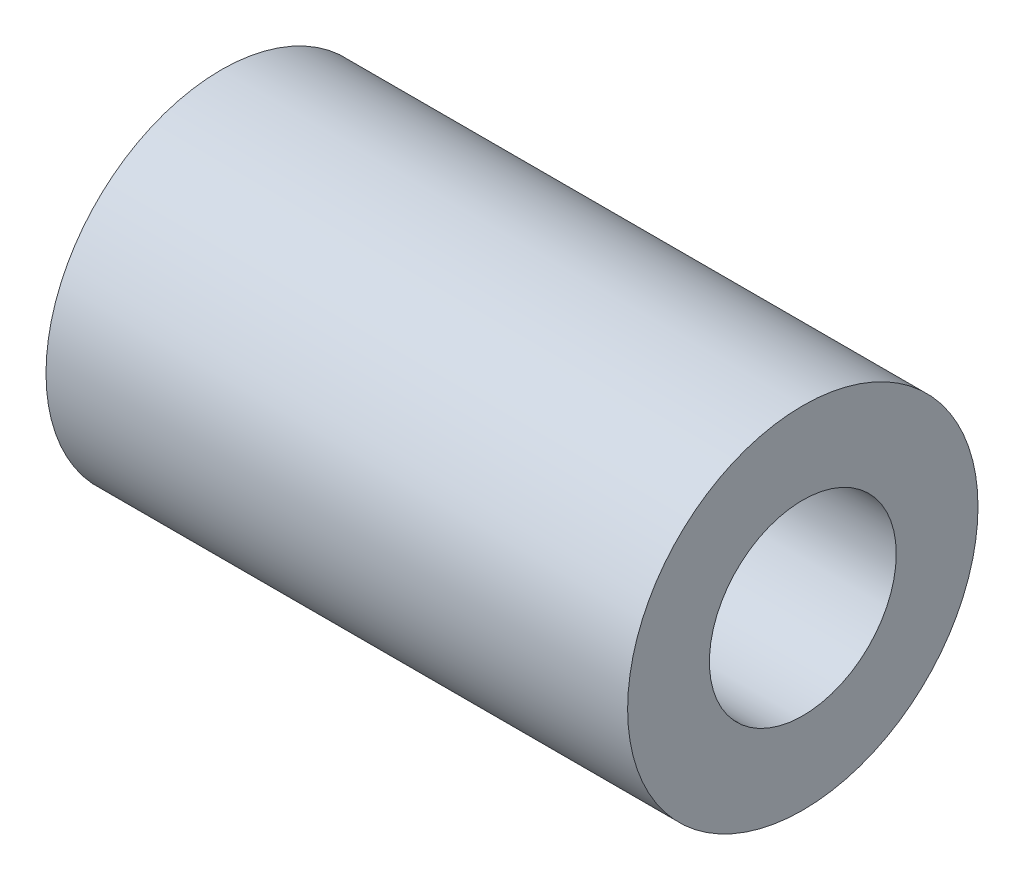
ISO-10303-21;
HEADER;
FILE_DESCRIPTION(('STEP AP214'),'2;1');
FILE_NAME('part.step','',(''),(''),'','','');
FILE_SCHEMA(('AUTOMOTIVE_DESIGN { 1 0 10303 214 1 1 1 1 }'));
ENDSEC;
DATA;
#1=APPLICATION_CONTEXT('core data for automotive mechanical design processes');
#2=APPLICATION_PROTOCOL_DEFINITION('international standard','automotive_design',2000,#1);
#3=PRODUCT_CONTEXT('',#1,'mechanical');
#4=PRODUCT('Part','Part','',(#3));
#5=PRODUCT_RELATED_PRODUCT_CATEGORY('part','',(#4));
#6=PRODUCT_DEFINITION_FORMATION('','',#4);
#7=PRODUCT_DEFINITION_CONTEXT('part definition',#1,'design');
#8=PRODUCT_DEFINITION('design','',#6,#7);
#9=PRODUCT_DEFINITION_SHAPE('','',#8);
#10=(LENGTH_UNIT() NAMED_UNIT(*) SI_UNIT(.MILLI.,.METRE.));
#11=(NAMED_UNIT(*) PLANE_ANGLE_UNIT() SI_UNIT($,.RADIAN.));
#12=(NAMED_UNIT(*) SI_UNIT($,.STERADIAN.) SOLID_ANGLE_UNIT());
#13=UNCERTAINTY_MEASURE_WITH_UNIT(LENGTH_MEASURE(1.E-05),#10,'distance_accuracy_value','');
#14=(GEOMETRIC_REPRESENTATION_CONTEXT(3) GLOBAL_UNCERTAINTY_ASSIGNED_CONTEXT((#13)) GLOBAL_UNIT_ASSIGNED_CONTEXT((#10,
#11,#12)) REPRESENTATION_CONTEXT('',''));
#15=CARTESIAN_POINT('',(0.,0.,0.));
#16=DIRECTION('',(0.,0.,1.));
#17=DIRECTION('',(1.,0.,0.));
#18=AXIS2_PLACEMENT_3D('',#15,#16,#17);
#19=CARTESIAN_POINT('',(24.9,0.,0.));
#20=DIRECTION('',(1.,0.,0.));
#21=DIRECTION('',(0.,0.,-1.));
#22=AXIS2_PLACEMENT_3D('',#19,#20,#21);
#23=PLANE('',#22);
#24=CARTESIAN_POINT('',(24.9,0.,0.));
#25=DIRECTION('',(1.,0.,0.));
#26=DIRECTION('',(0.,0.,-1.));
#27=AXIS2_PLACEMENT_3D('',#24,#25,#26);
#28=CIRCLE('',#27,7.5);
#29=CARTESIAN_POINT('',(24.9,0.,-7.5));
#30=VERTEX_POINT('',#29);
#31=EDGE_CURVE('E10',#30,#30,#28,.T.);
#32=ORIENTED_EDGE('',*,*,#31,.T.);
#33=EDGE_LOOP('',(#32));
#34=FACE_BOUND('',#33,.T.);
#35=CARTESIAN_POINT('',(24.9,0.,0.));
#36=DIRECTION('',(1.,0.,0.));
#37=DIRECTION('',(0.,0.,-1.));
#38=AXIS2_PLACEMENT_3D('',#35,#36,#37);
#39=CIRCLE('',#38,4.);
#40=CARTESIAN_POINT('',(24.9,0.,-4.));
#41=VERTEX_POINT('',#40);
#42=EDGE_CURVE('E41',#41,#41,#39,.T.);
#43=ORIENTED_EDGE('',*,*,#42,.F.);
#44=EDGE_LOOP('',(#43));
#45=FACE_BOUND('',#44,.T.);
#46=ADVANCED_FACE('F30',(#34,#45),#23,.T.);
#47=CARTESIAN_POINT('',(0.,0.,0.));
#48=DIRECTION('',(1.,0.,0.));
#49=DIRECTION('',(0.,0.,-1.));
#50=AXIS2_PLACEMENT_3D('',#47,#48,#49);
#51=PLANE('',#50);
#52=CARTESIAN_POINT('',(0.,0.,0.));
#53=DIRECTION('',(1.,0.,0.));
#54=DIRECTION('',(0.,0.,-1.));
#55=AXIS2_PLACEMENT_3D('',#52,#53,#54);
#56=CIRCLE('',#55,7.5);
#57=CARTESIAN_POINT('',(0.,0.,-7.5));
#58=VERTEX_POINT('',#57);
#59=EDGE_CURVE('E34',#58,#58,#56,.T.);
#60=ORIENTED_EDGE('',*,*,#59,.F.);
#61=EDGE_LOOP('',(#60));
#62=FACE_BOUND('',#61,.T.);
#63=CARTESIAN_POINT('',(0.,0.,0.));
#64=DIRECTION('',(1.,0.,0.));
#65=DIRECTION('',(0.,0.,-1.));
#66=AXIS2_PLACEMENT_3D('',#63,#64,#65);
#67=CIRCLE('',#66,4.);
#68=CARTESIAN_POINT('',(0.,0.,-4.));
#69=VERTEX_POINT('',#68);
#70=EDGE_CURVE('E43',#69,#69,#67,.T.);
#71=ORIENTED_EDGE('',*,*,#70,.T.);
#72=EDGE_LOOP('',(#71));
#73=FACE_BOUND('',#72,.T.);
#74=ADVANCED_FACE('F53',(#62,#73),#51,.F.);
#75=CARTESIAN_POINT('',(24.9,0.,0.));
#76=DIRECTION('',(-1.,0.,0.));
#77=DIRECTION('',(0.,0.,1.));
#78=AXIS2_PLACEMENT_3D('',#75,#76,#77);
#79=CYLINDRICAL_SURFACE('',#78,7.5);
#80=ORIENTED_EDGE('',*,*,#31,.F.);
#81=EDGE_LOOP('',(#80));
#82=FACE_BOUND('',#81,.T.);
#83=ORIENTED_EDGE('',*,*,#59,.T.);
#84=EDGE_LOOP('',(#83));
#85=FACE_BOUND('',#84,.T.);
#86=ADVANCED_FACE('F32',(#82,#85),#79,.T.);
#87=CARTESIAN_POINT('',(24.9,0.,0.));
#88=DIRECTION('',(-1.,0.,0.));
#89=DIRECTION('',(0.,0.,1.));
#90=AXIS2_PLACEMENT_3D('',#87,#88,#89);
#91=CYLINDRICAL_SURFACE('',#90,4.);
#92=ORIENTED_EDGE('',*,*,#42,.T.);
#93=EDGE_LOOP('',(#92));
#94=FACE_BOUND('',#93,.T.);
#95=ORIENTED_EDGE('',*,*,#70,.F.);
#96=EDGE_LOOP('',(#95));
#97=FACE_BOUND('',#96,.T.);
#98=ADVANCED_FACE('F49',(#94,#97),#91,.F.);
#99=CLOSED_SHELL('',(#46,#74,#86,#98));
#100=MANIFOLD_SOLID_BREP('B2',#99);
#101=ADVANCED_BREP_SHAPE_REPRESENTATION('',(#18,#100),#14);
#102=SHAPE_DEFINITION_REPRESENTATION(#9,#101);
ENDSEC;
END-ISO-10303-21;
